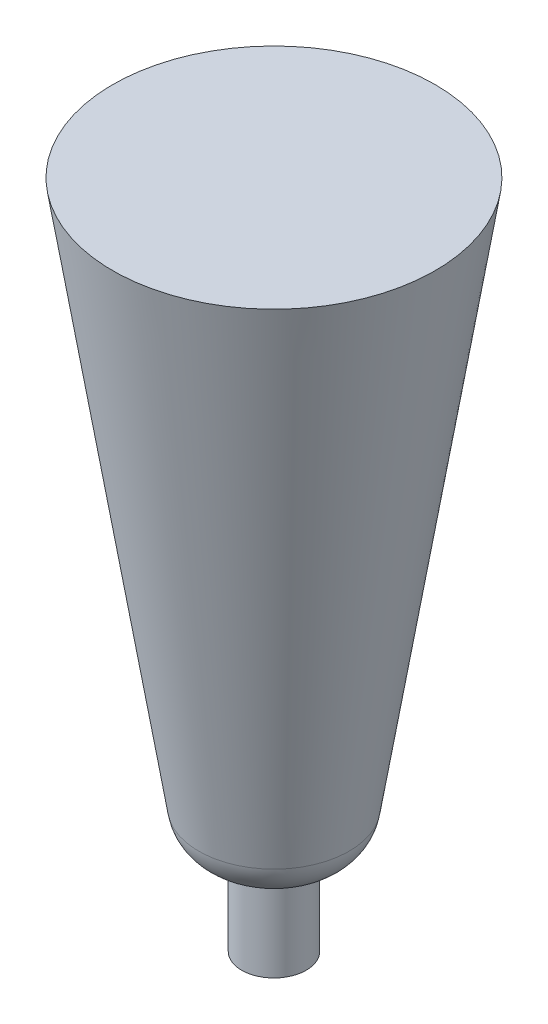
ISO-10303-21;
HEADER;
FILE_DESCRIPTION(('STEP AP214'),'2;1');
FILE_NAME('part.step','',(''),(''),'','','');
FILE_SCHEMA(('AUTOMOTIVE_DESIGN { 1 0 10303 214 1 1 1 1 }'));
ENDSEC;
DATA;
#1=APPLICATION_CONTEXT('core data for automotive mechanical design processes');
#2=APPLICATION_PROTOCOL_DEFINITION('international standard','automotive_design',2000,#1);
#3=PRODUCT_CONTEXT('',#1,'mechanical');
#4=PRODUCT('Part','Part','',(#3));
#5=PRODUCT_RELATED_PRODUCT_CATEGORY('part','',(#4));
#6=PRODUCT_DEFINITION_FORMATION('','',#4);
#7=PRODUCT_DEFINITION_CONTEXT('part definition',#1,'design');
#8=PRODUCT_DEFINITION('design','',#6,#7);
#9=PRODUCT_DEFINITION_SHAPE('','',#8);
#10=(LENGTH_UNIT() NAMED_UNIT(*) SI_UNIT(.MILLI.,.METRE.));
#11=(NAMED_UNIT(*) PLANE_ANGLE_UNIT() SI_UNIT($,.RADIAN.));
#12=(NAMED_UNIT(*) SI_UNIT($,.STERADIAN.) SOLID_ANGLE_UNIT());
#13=UNCERTAINTY_MEASURE_WITH_UNIT(LENGTH_MEASURE(1.E-05),#10,'distance_accuracy_value','');
#14=(GEOMETRIC_REPRESENTATION_CONTEXT(3) GLOBAL_UNCERTAINTY_ASSIGNED_CONTEXT((#13)) GLOBAL_UNIT_ASSIGNED_CONTEXT((#10,
#11,#12)) REPRESENTATION_CONTEXT('',''));
#15=CARTESIAN_POINT('',(0.,0.,0.));
#16=DIRECTION('',(0.,0.,1.));
#17=DIRECTION('',(1.,0.,0.));
#18=AXIS2_PLACEMENT_3D('',#15,#16,#17);
#19=CARTESIAN_POINT('',(0.,0.,0.));
#20=DIRECTION('',(0.,-1.,0.));
#21=DIRECTION('',(0.,0.,-1.));
#22=AXIS2_PLACEMENT_3D('',#19,#20,#21);
#23=PLANE('',#22);
#24=CARTESIAN_POINT('',(0.,0.,0.));
#25=DIRECTION('',(0.,-1.,0.));
#26=DIRECTION('',(0.,0.,-1.));
#27=AXIS2_PLACEMENT_3D('',#24,#25,#26);
#28=CIRCLE('',#27,3.81);
#29=CARTESIAN_POINT('',(0.,0.,-3.81));
#30=VERTEX_POINT('',#29);
#31=EDGE_CURVE('E10',#30,#30,#28,.T.);
#32=ORIENTED_EDGE('',*,*,#31,.T.);
#33=EDGE_LOOP('',(#32));
#34=FACE_BOUND('',#33,.T.);
#35=ADVANCED_FACE('F38',(#34),#23,.T.);
#36=CARTESIAN_POINT('',(0.,0.,0.));
#37=DIRECTION('',(0.,-1.,0.));
#38=DIRECTION('',(0.,0.,-1.));
#39=AXIS2_PLACEMENT_3D('',#36,#37,#38);
#40=CYLINDRICAL_SURFACE('',#39,3.81);
#41=CARTESIAN_POINT('',(0.,10.16,0.));
#42=DIRECTION('',(0.,-1.,0.));
#43=DIRECTION('',(0.,0.,-1.));
#44=AXIS2_PLACEMENT_3D('',#41,#42,#43);
#45=CIRCLE('',#44,3.81);
#46=CARTESIAN_POINT('',(0.,10.16,-3.81));
#47=VERTEX_POINT('',#46);
#48=EDGE_CURVE('E45',#47,#47,#45,.T.);
#49=ORIENTED_EDGE('',*,*,#48,.T.);
#50=EDGE_LOOP('',(#49));
#51=FACE_BOUND('',#50,.T.);
#52=ORIENTED_EDGE('',*,*,#31,.F.);
#53=EDGE_LOOP('',(#52));
#54=FACE_BOUND('',#53,.T.);
#55=ADVANCED_FACE('F74',(#51,#54),#40,.T.);
#56=CARTESIAN_POINT('',(0.,15.5145043407929,0.));
#57=DIRECTION('',(0.,-1.,0.));
#58=DIRECTION('',(0.,0.,-1.));
#59=AXIS2_PLACEMENT_3D('',#56,#57,#58);
#60=DEGENERATE_TOROIDAL_SURFACE('',#59,3.57291134545053,5.35975071861425,.T.);
#61=CARTESIAN_POINT('',(0.,14.6804380825505,0.));
#62=DIRECTION('',(0.,-1.,0.));
#63=DIRECTION('',(0.,0.,-1.));
#64=AXIS2_PLACEMENT_3D('',#61,#62,#63);
#65=CIRCLE('',#64,8.86736705331584);
#66=CARTESIAN_POINT('',(0.,14.6804380825505,-8.86736705331584));
#67=VERTEX_POINT('',#66);
#68=EDGE_CURVE('E50',#67,#67,#65,.T.);
#69=ORIENTED_EDGE('',*,*,#68,.T.);
#70=EDGE_LOOP('',(#69));
#71=FACE_BOUND('',#70,.T.);
#72=ORIENTED_EDGE('',*,*,#48,.F.);
#73=EDGE_LOOP('',(#72));
#74=FACE_BOUND('',#73,.T.);
#75=ADVANCED_FACE('F71',(#71,#74),#60,.T.);
#76=CARTESIAN_POINT('',(0.,16.3866210296416,0.));
#77=DIRECTION('',(0.,1.,0.));
#78=DIRECTION('',(0.,0.,1.));
#79=AXIS2_PLACEMENT_3D('',#76,#77,#78);
#80=CONICAL_SURFACE('',#79,9.13615193037943,0.156251641131122);
#81=CARTESIAN_POINT('',(0.,79.,0.));
#82=DIRECTION('',(0.,-1.,0.));
#83=DIRECTION('',(0.,0.,-1.));
#84=AXIS2_PLACEMENT_3D('',#81,#82,#83);
#85=CIRCLE('',#84,19.);
#86=CARTESIAN_POINT('',(0.,79.,-19.));
#87=VERTEX_POINT('',#86);
#88=EDGE_CURVE('E55',#87,#87,#85,.T.);
#89=ORIENTED_EDGE('',*,*,#88,.T.);
#90=EDGE_LOOP('',(#89));
#91=FACE_BOUND('',#90,.T.);
#92=ORIENTED_EDGE('',*,*,#68,.F.);
#93=EDGE_LOOP('',(#92));
#94=FACE_BOUND('',#93,.T.);
#95=ADVANCED_FACE('F62',(#91,#94),#80,.T.);
#96=CARTESIAN_POINT('',(0.,79.,0.));
#97=DIRECTION('',(0.,1.,0.));
#98=DIRECTION('',(0.,0.,1.));
#99=AXIS2_PLACEMENT_3D('',#96,#97,#98);
#100=PLANE('',#99);
#101=ORIENTED_EDGE('',*,*,#88,.F.);
#102=EDGE_LOOP('',(#101));
#103=FACE_BOUND('',#102,.T.);
#104=ADVANCED_FACE('F65',(#103),#100,.T.);
#105=CLOSED_SHELL('',(#35,#55,#75,#95,#104));
#106=MANIFOLD_SOLID_BREP('B2',#105);
#107=ADVANCED_BREP_SHAPE_REPRESENTATION('',(#18,#106),#14);
#108=SHAPE_DEFINITION_REPRESENTATION(#9,#107);
ENDSEC;
END-ISO-10303-21;
